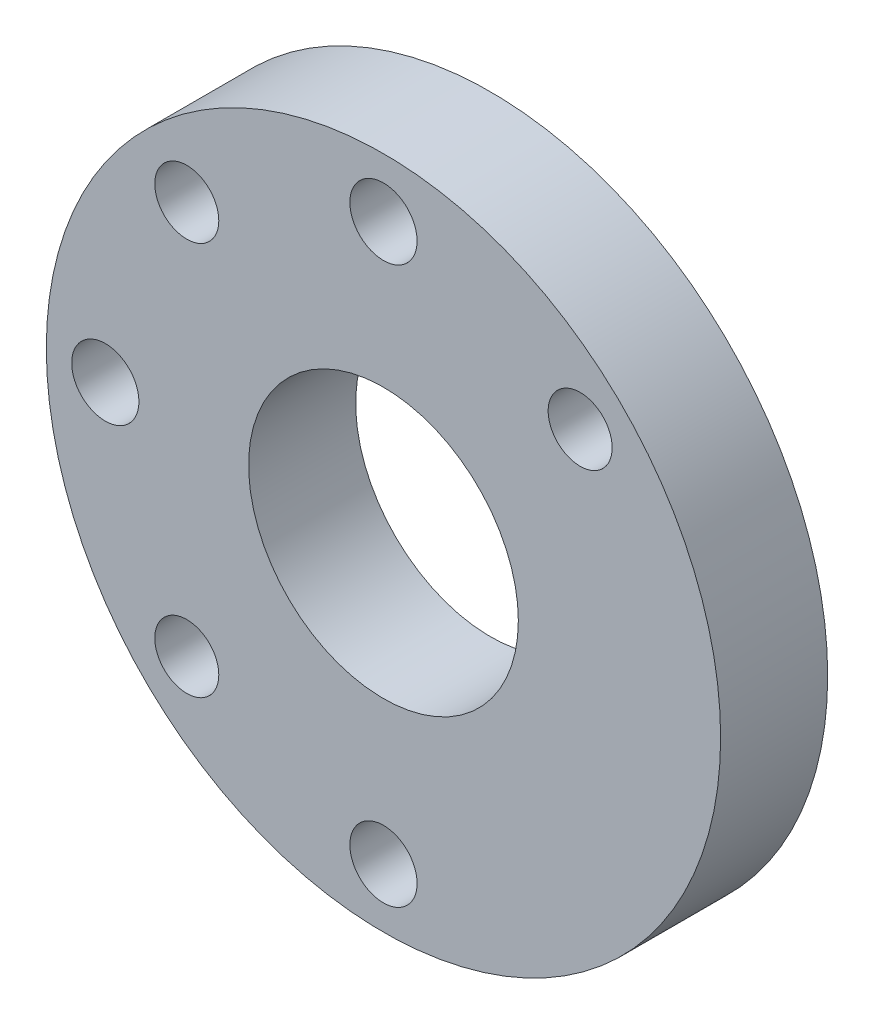
ISO-10303-21;
HEADER;
FILE_DESCRIPTION(('STEP AP214'),'2;1');
FILE_NAME('part.step','',(''),(''),'','','');
FILE_SCHEMA(('AUTOMOTIVE_DESIGN { 1 0 10303 214 1 1 1 1 }'));
ENDSEC;
DATA;
#1=APPLICATION_CONTEXT('core data for automotive mechanical design processes');
#2=APPLICATION_PROTOCOL_DEFINITION('international standard','automotive_design',2000,#1);
#3=PRODUCT_CONTEXT('',#1,'mechanical');
#4=PRODUCT('Part','Part','',(#3));
#5=PRODUCT_RELATED_PRODUCT_CATEGORY('part','',(#4));
#6=PRODUCT_DEFINITION_FORMATION('','',#4);
#7=PRODUCT_DEFINITION_CONTEXT('part definition',#1,'design');
#8=PRODUCT_DEFINITION('design','',#6,#7);
#9=PRODUCT_DEFINITION_SHAPE('','',#8);
#10=(LENGTH_UNIT() NAMED_UNIT(*) SI_UNIT(.MILLI.,.METRE.));
#11=(NAMED_UNIT(*) PLANE_ANGLE_UNIT() SI_UNIT($,.RADIAN.));
#12=(NAMED_UNIT(*) SI_UNIT($,.STERADIAN.) SOLID_ANGLE_UNIT());
#13=UNCERTAINTY_MEASURE_WITH_UNIT(LENGTH_MEASURE(1.E-05),#10,'distance_accuracy_value','');
#14=(GEOMETRIC_REPRESENTATION_CONTEXT(3) GLOBAL_UNCERTAINTY_ASSIGNED_CONTEXT((#13)) GLOBAL_UNIT_ASSIGNED_CONTEXT((#10,
#11,#12)) REPRESENTATION_CONTEXT('',''));
#15=CARTESIAN_POINT('',(0.,0.,0.));
#16=DIRECTION('',(0.,0.,1.));
#17=DIRECTION('',(1.,0.,0.));
#18=AXIS2_PLACEMENT_3D('',#15,#16,#17);
#19=CARTESIAN_POINT('',(0.,0.,6.35));
#20=DIRECTION('',(0.,0.,1.));
#21=DIRECTION('',(1.,0.,0.));
#22=AXIS2_PLACEMENT_3D('',#19,#20,#21);
#23=PLANE('',#22);
#24=CARTESIAN_POINT('',(-16.5,0.,6.35));
#25=DIRECTION('',(0.,0.,1.));
#26=DIRECTION('',(1.,0.,0.));
#27=AXIS2_PLACEMENT_3D('',#24,#25,#26);
#28=CIRCLE('',#27,1.9939);
#29=CARTESIAN_POINT('',(-14.5061,0.,6.35));
#30=VERTEX_POINT('',#29);
#31=EDGE_CURVE('E71',#30,#30,#28,.T.);
#32=ORIENTED_EDGE('',*,*,#31,.F.);
#33=EDGE_LOOP('',(#32));
#34=FACE_BOUND('',#33,.T.);
#35=CARTESIAN_POINT('',(0.,-16.5,6.35));
#36=DIRECTION('',(0.,0.,1.));
#37=DIRECTION('',(1.,0.,0.));
#38=AXIS2_PLACEMENT_3D('',#35,#36,#37);
#39=CIRCLE('',#38,1.9939);
#40=CARTESIAN_POINT('',(1.9939,-16.5,6.35));
#41=VERTEX_POINT('',#40);
#42=EDGE_CURVE('E59',#41,#41,#39,.T.);
#43=ORIENTED_EDGE('',*,*,#42,.F.);
#44=EDGE_LOOP('',(#43));
#45=FACE_BOUND('',#44,.T.);
#46=CARTESIAN_POINT('',(0.,16.5,6.35));
#47=DIRECTION('',(0.,0.,1.));
#48=DIRECTION('',(1.,0.,0.));
#49=AXIS2_PLACEMENT_3D('',#46,#47,#48);
#50=CIRCLE('',#49,1.9939);
#51=CARTESIAN_POINT('',(1.9939,16.5,6.35));
#52=VERTEX_POINT('',#51);
#53=EDGE_CURVE('E47',#52,#52,#50,.T.);
#54=ORIENTED_EDGE('',*,*,#53,.F.);
#55=EDGE_LOOP('',(#54));
#56=FACE_BOUND('',#55,.T.);
#57=CARTESIAN_POINT('',(0.,0.,6.35));
#58=DIRECTION('',(0.,0.,1.));
#59=DIRECTION('',(1.,0.,0.));
#60=AXIS2_PLACEMENT_3D('',#57,#58,#59);
#61=CIRCLE('',#60,20.);
#62=CARTESIAN_POINT('',(20.,0.,6.35));
#63=VERTEX_POINT('',#62);
#64=EDGE_CURVE('E10',#63,#63,#61,.T.);
#65=ORIENTED_EDGE('',*,*,#64,.T.);
#66=EDGE_LOOP('',(#65));
#67=FACE_BOUND('',#66,.T.);
#68=CARTESIAN_POINT('',(0.,0.,6.35));
#69=DIRECTION('',(0.,0.,1.));
#70=DIRECTION('',(1.,0.,0.));
#71=AXIS2_PLACEMENT_3D('',#68,#69,#70);
#72=CIRCLE('',#71,8.);
#73=CARTESIAN_POINT('',(8.,0.,6.35));
#74=VERTEX_POINT('',#73);
#75=EDGE_CURVE('E42',#74,#74,#72,.T.);
#76=ORIENTED_EDGE('',*,*,#75,.F.);
#77=EDGE_LOOP('',(#76));
#78=FACE_BOUND('',#77,.T.);
#79=CARTESIAN_POINT('',(11.6672618895781,11.667261889578,6.35));
#80=DIRECTION('',(0.,0.,1.));
#81=DIRECTION('',(1.,0.,0.));
#82=AXIS2_PLACEMENT_3D('',#79,#80,#81);
#83=CIRCLE('',#82,1.89865);
#84=CARTESIAN_POINT('',(13.5659118895781,11.667261889578,6.35));
#85=VERTEX_POINT('',#84);
#86=EDGE_CURVE('E53',#85,#85,#83,.T.);
#87=ORIENTED_EDGE('',*,*,#86,.F.);
#88=EDGE_LOOP('',(#87));
#89=FACE_BOUND('',#88,.T.);
#90=CARTESIAN_POINT('',(-11.6672618895781,-11.667261889578,6.35));
#91=DIRECTION('',(0.,0.,1.));
#92=DIRECTION('',(1.,0.,0.));
#93=AXIS2_PLACEMENT_3D('',#90,#91,#92);
#94=CIRCLE('',#93,1.89865);
#95=CARTESIAN_POINT('',(-9.76861188957806,-11.667261889578,6.35));
#96=VERTEX_POINT('',#95);
#97=EDGE_CURVE('E65',#96,#96,#94,.T.);
#98=ORIENTED_EDGE('',*,*,#97,.F.);
#99=EDGE_LOOP('',(#98));
#100=FACE_BOUND('',#99,.T.);
#101=CARTESIAN_POINT('',(-11.667261889578,11.6672618895781,6.35));
#102=DIRECTION('',(0.,0.,1.));
#103=DIRECTION('',(1.,0.,0.));
#104=AXIS2_PLACEMENT_3D('',#101,#102,#103);
#105=CIRCLE('',#104,1.89865);
#106=CARTESIAN_POINT('',(-9.76861188957802,11.6672618895781,6.35));
#107=VERTEX_POINT('',#106);
#108=EDGE_CURVE('E77',#107,#107,#105,.T.);
#109=ORIENTED_EDGE('',*,*,#108,.F.);
#110=EDGE_LOOP('',(#109));
#111=FACE_BOUND('',#110,.T.);
#112=ADVANCED_FACE('F31',(#34,#45,#56,#67,#78,#89,#100,#111),#23,.T.);
#113=CARTESIAN_POINT('',(0.,0.,0.));
#114=DIRECTION('',(0.,0.,1.));
#115=DIRECTION('',(1.,0.,0.));
#116=AXIS2_PLACEMENT_3D('',#113,#114,#115);
#117=PLANE('',#116);
#118=CARTESIAN_POINT('',(0.,0.,0.));
#119=DIRECTION('',(0.,0.,1.));
#120=DIRECTION('',(1.,0.,0.));
#121=AXIS2_PLACEMENT_3D('',#118,#119,#120);
#122=CIRCLE('',#121,20.);
#123=CARTESIAN_POINT('',(20.,0.,0.));
#124=VERTEX_POINT('',#123);
#125=EDGE_CURVE('E35',#124,#124,#122,.T.);
#126=ORIENTED_EDGE('',*,*,#125,.F.);
#127=EDGE_LOOP('',(#126));
#128=FACE_BOUND('',#127,.T.);
#129=CARTESIAN_POINT('',(0.,0.,0.));
#130=DIRECTION('',(0.,0.,1.));
#131=DIRECTION('',(1.,0.,0.));
#132=AXIS2_PLACEMENT_3D('',#129,#130,#131);
#133=CIRCLE('',#132,8.);
#134=CARTESIAN_POINT('',(8.,0.,0.));
#135=VERTEX_POINT('',#134);
#136=EDGE_CURVE('E44',#135,#135,#133,.T.);
#137=ORIENTED_EDGE('',*,*,#136,.T.);
#138=EDGE_LOOP('',(#137));
#139=FACE_BOUND('',#138,.T.);
#140=CARTESIAN_POINT('',(0.,16.5,0.));
#141=DIRECTION('',(0.,0.,1.));
#142=DIRECTION('',(1.,0.,0.));
#143=AXIS2_PLACEMENT_3D('',#140,#141,#142);
#144=CIRCLE('',#143,1.9939);
#145=CARTESIAN_POINT('',(1.9939,16.5,0.));
#146=VERTEX_POINT('',#145);
#147=EDGE_CURVE('E50',#146,#146,#144,.T.);
#148=ORIENTED_EDGE('',*,*,#147,.T.);
#149=EDGE_LOOP('',(#148));
#150=FACE_BOUND('',#149,.T.);
#151=CARTESIAN_POINT('',(11.6672618895781,11.667261889578,0.));
#152=DIRECTION('',(0.,0.,1.));
#153=DIRECTION('',(1.,0.,0.));
#154=AXIS2_PLACEMENT_3D('',#151,#152,#153);
#155=CIRCLE('',#154,1.89865);
#156=CARTESIAN_POINT('',(13.5659118895781,11.667261889578,0.));
#157=VERTEX_POINT('',#156);
#158=EDGE_CURVE('E56',#157,#157,#155,.T.);
#159=ORIENTED_EDGE('',*,*,#158,.T.);
#160=EDGE_LOOP('',(#159));
#161=FACE_BOUND('',#160,.T.);
#162=CARTESIAN_POINT('',(0.,-16.5,0.));
#163=DIRECTION('',(0.,0.,1.));
#164=DIRECTION('',(1.,0.,0.));
#165=AXIS2_PLACEMENT_3D('',#162,#163,#164);
#166=CIRCLE('',#165,1.9939);
#167=CARTESIAN_POINT('',(1.9939,-16.5,0.));
#168=VERTEX_POINT('',#167);
#169=EDGE_CURVE('E62',#168,#168,#166,.T.);
#170=ORIENTED_EDGE('',*,*,#169,.T.);
#171=EDGE_LOOP('',(#170));
#172=FACE_BOUND('',#171,.T.);
#173=CARTESIAN_POINT('',(-11.6672618895781,-11.667261889578,0.));
#174=DIRECTION('',(0.,0.,1.));
#175=DIRECTION('',(1.,0.,0.));
#176=AXIS2_PLACEMENT_3D('',#173,#174,#175);
#177=CIRCLE('',#176,1.89865);
#178=CARTESIAN_POINT('',(-9.76861188957806,-11.667261889578,0.));
#179=VERTEX_POINT('',#178);
#180=EDGE_CURVE('E68',#179,#179,#177,.T.);
#181=ORIENTED_EDGE('',*,*,#180,.T.);
#182=EDGE_LOOP('',(#181));
#183=FACE_BOUND('',#182,.T.);
#184=CARTESIAN_POINT('',(-16.5,0.,0.));
#185=DIRECTION('',(0.,0.,1.));
#186=DIRECTION('',(1.,0.,0.));
#187=AXIS2_PLACEMENT_3D('',#184,#185,#186);
#188=CIRCLE('',#187,1.9939);
#189=CARTESIAN_POINT('',(-14.5061,0.,0.));
#190=VERTEX_POINT('',#189);
#191=EDGE_CURVE('E74',#190,#190,#188,.T.);
#192=ORIENTED_EDGE('',*,*,#191,.T.);
#193=EDGE_LOOP('',(#192));
#194=FACE_BOUND('',#193,.T.);
#195=CARTESIAN_POINT('',(-11.667261889578,11.6672618895781,0.));
#196=DIRECTION('',(0.,0.,1.));
#197=DIRECTION('',(1.,0.,0.));
#198=AXIS2_PLACEMENT_3D('',#195,#196,#197);
#199=CIRCLE('',#198,1.89865);
#200=CARTESIAN_POINT('',(-9.76861188957802,11.6672618895781,0.));
#201=VERTEX_POINT('',#200);
#202=EDGE_CURVE('E80',#201,#201,#199,.T.);
#203=ORIENTED_EDGE('',*,*,#202,.T.);
#204=EDGE_LOOP('',(#203));
#205=FACE_BOUND('',#204,.T.);
#206=ADVANCED_FACE('F90',(#128,#139,#150,#161,#172,#183,#194,#205),#117,.F.);
#207=CARTESIAN_POINT('',(0.,0.,6.35));
#208=DIRECTION('',(0.,0.,-1.));
#209=DIRECTION('',(-1.,0.,0.));
#210=AXIS2_PLACEMENT_3D('',#207,#208,#209);
#211=CYLINDRICAL_SURFACE('',#210,20.);
#212=ORIENTED_EDGE('',*,*,#64,.F.);
#213=EDGE_LOOP('',(#212));
#214=FACE_BOUND('',#213,.T.);
#215=ORIENTED_EDGE('',*,*,#125,.T.);
#216=EDGE_LOOP('',(#215));
#217=FACE_BOUND('',#216,.T.);
#218=ADVANCED_FACE('F33',(#214,#217),#211,.T.);
#219=CARTESIAN_POINT('',(0.,0.,6.35));
#220=DIRECTION('',(0.,0.,-1.));
#221=DIRECTION('',(-1.,0.,0.));
#222=AXIS2_PLACEMENT_3D('',#219,#220,#221);
#223=CYLINDRICAL_SURFACE('',#222,8.);
#224=ORIENTED_EDGE('',*,*,#75,.T.);
#225=EDGE_LOOP('',(#224));
#226=FACE_BOUND('',#225,.T.);
#227=ORIENTED_EDGE('',*,*,#136,.F.);
#228=EDGE_LOOP('',(#227));
#229=FACE_BOUND('',#228,.T.);
#230=ADVANCED_FACE('F100',(#226,#229),#223,.F.);
#231=CARTESIAN_POINT('',(0.,16.5,6.35));
#232=DIRECTION('',(0.,0.,-1.));
#233=DIRECTION('',(-1.,0.,0.));
#234=AXIS2_PLACEMENT_3D('',#231,#232,#233);
#235=CYLINDRICAL_SURFACE('',#234,1.9939);
#236=ORIENTED_EDGE('',*,*,#53,.T.);
#237=EDGE_LOOP('',(#236));
#238=FACE_BOUND('',#237,.T.);
#239=ORIENTED_EDGE('',*,*,#147,.F.);
#240=EDGE_LOOP('',(#239));
#241=FACE_BOUND('',#240,.T.);
#242=ADVANCED_FACE('F103',(#238,#241),#235,.F.);
#243=CARTESIAN_POINT('',(11.6672618895781,11.667261889578,6.35));
#244=DIRECTION('',(0.,0.,-1.));
#245=DIRECTION('',(-1.,0.,0.));
#246=AXIS2_PLACEMENT_3D('',#243,#244,#245);
#247=CYLINDRICAL_SURFACE('',#246,1.89865);
#248=ORIENTED_EDGE('',*,*,#86,.T.);
#249=EDGE_LOOP('',(#248));
#250=FACE_BOUND('',#249,.T.);
#251=ORIENTED_EDGE('',*,*,#158,.F.);
#252=EDGE_LOOP('',(#251));
#253=FACE_BOUND('',#252,.T.);
#254=ADVANCED_FACE('F107',(#250,#253),#247,.F.);
#255=CARTESIAN_POINT('',(0.,-16.5,6.35));
#256=DIRECTION('',(0.,0.,-1.));
#257=DIRECTION('',(-1.,0.,0.));
#258=AXIS2_PLACEMENT_3D('',#255,#256,#257);
#259=CYLINDRICAL_SURFACE('',#258,1.9939);
#260=ORIENTED_EDGE('',*,*,#42,.T.);
#261=EDGE_LOOP('',(#260));
#262=FACE_BOUND('',#261,.T.);
#263=ORIENTED_EDGE('',*,*,#169,.F.);
#264=EDGE_LOOP('',(#263));
#265=FACE_BOUND('',#264,.T.);
#266=ADVANCED_FACE('F111',(#262,#265),#259,.F.);
#267=CARTESIAN_POINT('',(-11.6672618895781,-11.667261889578,6.35));
#268=DIRECTION('',(0.,0.,-1.));
#269=DIRECTION('',(-1.,0.,0.));
#270=AXIS2_PLACEMENT_3D('',#267,#268,#269);
#271=CYLINDRICAL_SURFACE('',#270,1.89865);
#272=ORIENTED_EDGE('',*,*,#97,.T.);
#273=EDGE_LOOP('',(#272));
#274=FACE_BOUND('',#273,.T.);
#275=ORIENTED_EDGE('',*,*,#180,.F.);
#276=EDGE_LOOP('',(#275));
#277=FACE_BOUND('',#276,.T.);
#278=ADVANCED_FACE('F115',(#274,#277),#271,.F.);
#279=CARTESIAN_POINT('',(-16.5,0.,6.35));
#280=DIRECTION('',(0.,0.,-1.));
#281=DIRECTION('',(-1.,0.,0.));
#282=AXIS2_PLACEMENT_3D('',#279,#280,#281);
#283=CYLINDRICAL_SURFACE('',#282,1.9939);
#284=ORIENTED_EDGE('',*,*,#31,.T.);
#285=EDGE_LOOP('',(#284));
#286=FACE_BOUND('',#285,.T.);
#287=ORIENTED_EDGE('',*,*,#191,.F.);
#288=EDGE_LOOP('',(#287));
#289=FACE_BOUND('',#288,.T.);
#290=ADVANCED_FACE('F119',(#286,#289),#283,.F.);
#291=CARTESIAN_POINT('',(-11.667261889578,11.6672618895781,6.35));
#292=DIRECTION('',(0.,0.,-1.));
#293=DIRECTION('',(-1.,0.,0.));
#294=AXIS2_PLACEMENT_3D('',#291,#292,#293);
#295=CYLINDRICAL_SURFACE('',#294,1.89865);
#296=ORIENTED_EDGE('',*,*,#108,.T.);
#297=EDGE_LOOP('',(#296));
#298=FACE_BOUND('',#297,.T.);
#299=ORIENTED_EDGE('',*,*,#202,.F.);
#300=EDGE_LOOP('',(#299));
#301=FACE_BOUND('',#300,.T.);
#302=ADVANCED_FACE('F86',(#298,#301),#295,.F.);
#303=CLOSED_SHELL('',(#112,#206,#218,#230,#242,#254,#266,#278,#290,#302));
#304=MANIFOLD_SOLID_BREP('B2',#303);
#305=ADVANCED_BREP_SHAPE_REPRESENTATION('',(#18,#304),#14);
#306=SHAPE_DEFINITION_REPRESENTATION(#9,#305);
ENDSEC;
END-ISO-10303-21;
